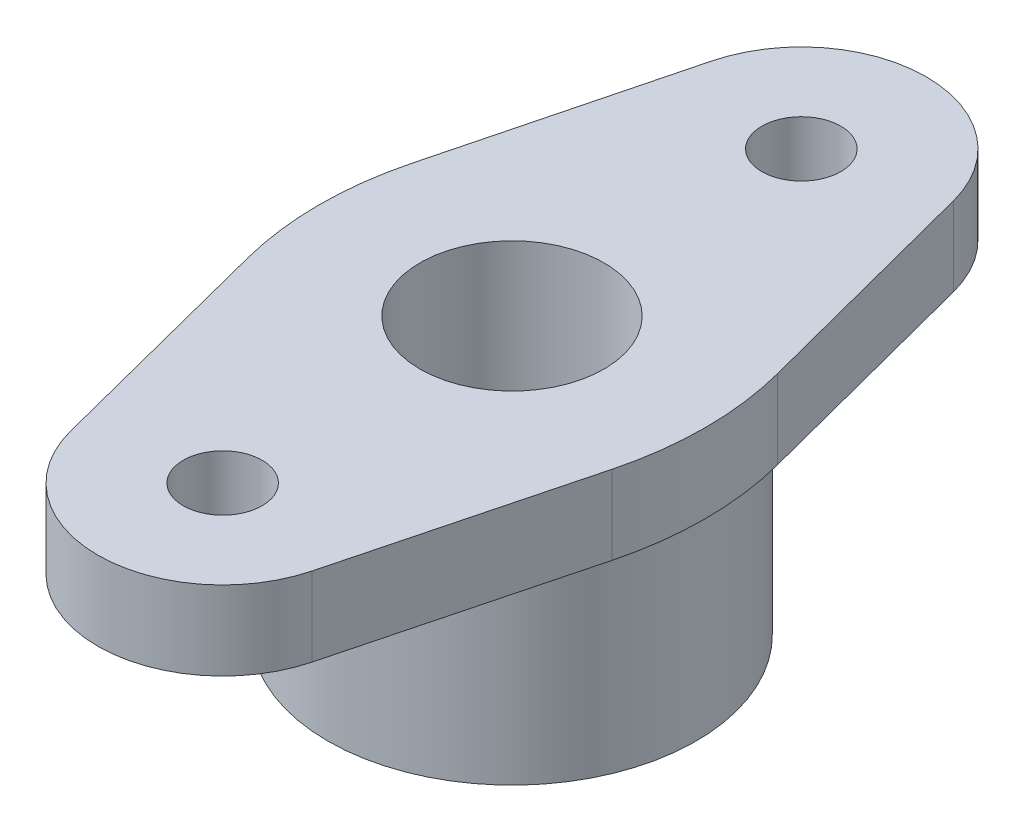
ISO-10303-21;
HEADER;
FILE_DESCRIPTION(('STEP AP214'),'2;1');
FILE_NAME('part.step','',(''),(''),'','','');
FILE_SCHEMA(('AUTOMOTIVE_DESIGN { 1 0 10303 214 1 1 1 1 }'));
ENDSEC;
DATA;
#1=APPLICATION_CONTEXT('core data for automotive mechanical design processes');
#2=APPLICATION_PROTOCOL_DEFINITION('international standard','automotive_design',2000,#1);
#3=PRODUCT_CONTEXT('',#1,'mechanical');
#4=PRODUCT('Part','Part','',(#3));
#5=PRODUCT_RELATED_PRODUCT_CATEGORY('part','',(#4));
#6=PRODUCT_DEFINITION_FORMATION('','',#4);
#7=PRODUCT_DEFINITION_CONTEXT('part definition',#1,'design');
#8=PRODUCT_DEFINITION('design','',#6,#7);
#9=PRODUCT_DEFINITION_SHAPE('','',#8);
#10=(LENGTH_UNIT() NAMED_UNIT(*) SI_UNIT(.MILLI.,.METRE.));
#11=(NAMED_UNIT(*) PLANE_ANGLE_UNIT() SI_UNIT($,.RADIAN.));
#12=(NAMED_UNIT(*) SI_UNIT($,.STERADIAN.) SOLID_ANGLE_UNIT());
#13=UNCERTAINTY_MEASURE_WITH_UNIT(LENGTH_MEASURE(1.E-05),#10,'distance_accuracy_value','');
#14=(GEOMETRIC_REPRESENTATION_CONTEXT(3) GLOBAL_UNCERTAINTY_ASSIGNED_CONTEXT((#13)) GLOBAL_UNIT_ASSIGNED_CONTEXT((#10,
#11,#12)) REPRESENTATION_CONTEXT('',''));
#15=CARTESIAN_POINT('',(0.,0.,0.));
#16=DIRECTION('',(0.,0.,1.));
#17=DIRECTION('',(1.,0.,0.));
#18=AXIS2_PLACEMENT_3D('',#15,#16,#17);
#19=CARTESIAN_POINT('',(-29.0153568552386,12.,7.46240356318299));
#20=DIRECTION('',(-0.968482370874399,0.,0.249082109565307));
#21=DIRECTION('',(0.249082109565307,0.,0.968482370874399));
#22=AXIS2_PLACEMENT_3D('',#19,#20,#21);
#23=PLANE('',#22);
#24=DIRECTION('',(-0.249082109565307,0.,-0.968482370874399));
#25=VECTOR('',#24,1.);
#26=CARTESIAN_POINT('',(-29.0153568552386,12.,7.46240356318299));
#27=LINE('',#26,#25);
#28=CARTESIAN_POINT('',(-18.4011650466136,12.,48.7325600817408));
#29=VERTEX_POINT('',#28);
#30=CARTESIAN_POINT('',(-27.7315506851714,12.,12.4541054782653));
#31=VERTEX_POINT('',#30);
#32=EDGE_CURVE('E119',#29,#31,#27,.T.);
#33=ORIENTED_EDGE('',*,*,#32,.T.);
#34=DIRECTION('',(0.,-1.,0.));
#35=VECTOR('',#34,1.);
#36=CARTESIAN_POINT('',(-27.7315506851714,0.,12.4541054782653));
#37=LINE('',#36,#35);
#38=CARTESIAN_POINT('',(-27.7315506851714,0.,12.4541054782653));
#39=VERTEX_POINT('',#38);
#40=EDGE_CURVE('E128',#31,#39,#37,.T.);
#41=ORIENTED_EDGE('',*,*,#40,.T.);
#42=DIRECTION('',(-0.249082109565307,0.,-0.968482370874399));
#43=VECTOR('',#42,1.);
#44=CARTESIAN_POINT('',(-29.0153568552386,0.,7.46240356318299));
#45=LINE('',#44,#43);
#46=CARTESIAN_POINT('',(-18.4011650466136,0.,48.7325600817408));
#47=VERTEX_POINT('',#46);
#48=EDGE_CURVE('E122',#47,#39,#45,.T.);
#49=ORIENTED_EDGE('',*,*,#48,.F.);
#50=DIRECTION('',(0.,-1.,0.));
#51=VECTOR('',#50,1.);
#52=CARTESIAN_POINT('',(-18.4011650466136,12.,48.7325600817408));
#53=LINE('',#52,#51);
#54=EDGE_CURVE('E116',#29,#47,#53,.T.);
#55=ORIENTED_EDGE('',*,*,#54,.F.);
#56=EDGE_LOOP('',(#33,#41,#49,#55));
#57=FACE_BOUND('',#56,.T.);
#58=ADVANCED_FACE('F48',(#57),#23,.T.);
#59=CARTESIAN_POINT('',(0.,12.,44.));
#60=DIRECTION('',(0.,-1.,0.));
#61=DIRECTION('',(0.,0.,-1.));
#62=AXIS2_PLACEMENT_3D('',#59,#60,#61);
#63=CYLINDRICAL_SURFACE('',#62,19.);
#64=CARTESIAN_POINT('',(0.,0.,44.));
#65=DIRECTION('',(0.,1.,0.));
#66=DIRECTION('',(0.,0.,1.));
#67=AXIS2_PLACEMENT_3D('',#64,#65,#66);
#68=CIRCLE('',#67,19.);
#69=CARTESIAN_POINT('',(18.3892056051442,0.,48.7788196462864));
#70=VERTEX_POINT('',#69);
#71=EDGE_CURVE('E170',#70,#47,#68,.F.);
#72=ORIENTED_EDGE('',*,*,#71,.F.);
#73=DIRECTION('',(0.,-1.,0.));
#74=VECTOR('',#73,1.);
#75=CARTESIAN_POINT('',(18.3892056051442,12.,48.7788196462864));
#76=LINE('',#75,#74);
#77=CARTESIAN_POINT('',(18.3892056051442,12.,48.7788196462864));
#78=VERTEX_POINT('',#77);
#79=EDGE_CURVE('E129',#78,#70,#76,.T.);
#80=ORIENTED_EDGE('',*,*,#79,.F.);
#81=CARTESIAN_POINT('',(0.,12.,44.));
#82=DIRECTION('',(0.,1.,0.));
#83=DIRECTION('',(0.,0.,1.));
#84=AXIS2_PLACEMENT_3D('',#81,#82,#83);
#85=CIRCLE('',#84,19.);
#86=EDGE_CURVE('E135',#78,#29,#85,.F.);
#87=ORIENTED_EDGE('',*,*,#86,.T.);
#88=ORIENTED_EDGE('',*,*,#54,.T.);
#89=EDGE_LOOP('',(#72,#80,#87,#88));
#90=FACE_BOUND('',#89,.T.);
#91=ADVANCED_FACE('F141',(#90),#63,.T.);
#92=CARTESIAN_POINT('',(29.1001825279153,12.,7.56229099619282));
#93=DIRECTION('',(-0.967852926586538,0.,-0.251516823488756));
#94=DIRECTION('',(-0.251516823488756,0.,0.967852926586538));
#95=AXIS2_PLACEMENT_3D('',#92,#93,#94);
#96=PLANE('',#95);
#97=DIRECTION('',(0.251516823488756,0.,-0.967852926586538));
#98=VECTOR('',#97,1.);
#99=CARTESIAN_POINT('',(29.1001825279153,0.,7.56229099619282));
#100=LINE('',#99,#98);
#101=CARTESIAN_POINT('',(27.7973066667232,0.,12.5758411744378));
#102=VERTEX_POINT('',#101);
#103=EDGE_CURVE('E174',#70,#102,#100,.T.);
#104=ORIENTED_EDGE('',*,*,#103,.T.);
#105=DIRECTION('',(0.,-1.,0.));
#106=VECTOR('',#105,1.);
#107=CARTESIAN_POINT('',(27.7973066667232,12.,12.5758411744378));
#108=LINE('',#107,#106);
#109=CARTESIAN_POINT('',(27.7973066667232,12.,12.5758411744378));
#110=VERTEX_POINT('',#109);
#111=EDGE_CURVE('E57',#102,#110,#108,.F.);
#112=ORIENTED_EDGE('',*,*,#111,.T.);
#113=DIRECTION('',(0.251516823488756,0.,-0.967852926586538));
#114=VECTOR('',#113,1.);
#115=CARTESIAN_POINT('',(29.1001825279153,12.,7.56229099619282));
#116=LINE('',#115,#114);
#117=EDGE_CURVE('E143',#78,#110,#116,.T.);
#118=ORIENTED_EDGE('',*,*,#117,.F.);
#119=ORIENTED_EDGE('',*,*,#79,.T.);
#120=EDGE_LOOP('',(#104,#112,#118,#119));
#121=FACE_BOUND('',#120,.T.);
#122=ADVANCED_FACE('F242',(#121),#96,.F.);
#123=CARTESIAN_POINT('',(29.1001825279153,12.,-7.56229099619282));
#124=DIRECTION('',(0.967852926586538,0.,-0.251516823488756));
#125=DIRECTION('',(-0.251516823488756,0.,-0.967852926586538));
#126=AXIS2_PLACEMENT_3D('',#123,#124,#125);
#127=PLANE('',#126);
#128=DIRECTION('',(0.251516823488756,0.,0.967852926586538));
#129=VECTOR('',#128,1.);
#130=CARTESIAN_POINT('',(29.1001825279153,12.,-7.56229099619282));
#131=LINE('',#130,#129);
#132=CARTESIAN_POINT('',(18.3892056051442,12.,-48.7788196462864));
#133=VERTEX_POINT('',#132);
#134=CARTESIAN_POINT('',(27.7973066667232,12.,-12.5758411744378));
#135=VERTEX_POINT('',#134);
#136=EDGE_CURVE('E146',#133,#135,#131,.T.);
#137=ORIENTED_EDGE('',*,*,#136,.T.);
#138=DIRECTION('',(0.,-1.,0.));
#139=VECTOR('',#138,1.);
#140=CARTESIAN_POINT('',(27.7973066667232,0.,-12.5758411744378));
#141=LINE('',#140,#139);
#142=CARTESIAN_POINT('',(27.7973066667232,0.,-12.5758411744378));
#143=VERTEX_POINT('',#142);
#144=EDGE_CURVE('E220',#135,#143,#141,.T.);
#145=ORIENTED_EDGE('',*,*,#144,.T.);
#146=DIRECTION('',(0.251516823488756,0.,0.967852926586538));
#147=VECTOR('',#146,1.);
#148=CARTESIAN_POINT('',(29.1001825279153,0.,-7.56229099619282));
#149=LINE('',#148,#147);
#150=CARTESIAN_POINT('',(18.3892056051442,0.,-48.7788196462864));
#151=VERTEX_POINT('',#150);
#152=EDGE_CURVE('E177',#151,#143,#149,.T.);
#153=ORIENTED_EDGE('',*,*,#152,.F.);
#154=DIRECTION('',(0.,-1.,0.));
#155=VECTOR('',#154,1.);
#156=CARTESIAN_POINT('',(18.3892056051442,12.,-48.7788196462864));
#157=LINE('',#156,#155);
#158=EDGE_CURVE('E200',#133,#151,#157,.T.);
#159=ORIENTED_EDGE('',*,*,#158,.F.);
#160=EDGE_LOOP('',(#137,#145,#153,#159));
#161=FACE_BOUND('',#160,.T.);
#162=ADVANCED_FACE('F227',(#161),#127,.T.);
#163=CARTESIAN_POINT('',(0.,12.,-44.));
#164=DIRECTION('',(0.,-1.,0.));
#165=DIRECTION('',(0.,0.,-1.));
#166=AXIS2_PLACEMENT_3D('',#163,#164,#165);
#167=CYLINDRICAL_SURFACE('',#166,19.);
#168=CARTESIAN_POINT('',(0.,0.,-44.));
#169=DIRECTION('',(0.,1.,0.));
#170=DIRECTION('',(0.,0.,1.));
#171=AXIS2_PLACEMENT_3D('',#168,#169,#170);
#172=CIRCLE('',#171,19.);
#173=CARTESIAN_POINT('',(-18.4011650466136,0.,-48.7325600817408));
#174=VERTEX_POINT('',#173);
#175=EDGE_CURVE('E181',#151,#174,#172,.T.);
#176=ORIENTED_EDGE('',*,*,#175,.T.);
#177=DIRECTION('',(0.,-1.,0.));
#178=VECTOR('',#177,1.);
#179=CARTESIAN_POINT('',(-18.4011650466136,12.,-48.7325600817408));
#180=LINE('',#179,#178);
#181=CARTESIAN_POINT('',(-18.4011650466136,12.,-48.7325600817408));
#182=VERTEX_POINT('',#181);
#183=EDGE_CURVE('E167',#182,#174,#180,.T.);
#184=ORIENTED_EDGE('',*,*,#183,.F.);
#185=CARTESIAN_POINT('',(0.,12.,-44.));
#186=DIRECTION('',(0.,1.,0.));
#187=DIRECTION('',(0.,0.,1.));
#188=AXIS2_PLACEMENT_3D('',#185,#186,#187);
#189=CIRCLE('',#188,19.);
#190=EDGE_CURVE('E152',#133,#182,#189,.T.);
#191=ORIENTED_EDGE('',*,*,#190,.F.);
#192=ORIENTED_EDGE('',*,*,#158,.T.);
#193=EDGE_LOOP('',(#176,#184,#191,#192));
#194=FACE_BOUND('',#193,.T.);
#195=ADVANCED_FACE('F236',(#194),#167,.T.);
#196=CARTESIAN_POINT('',(0.,12.,-44.));
#197=DIRECTION('',(0.,-1.,0.));
#198=DIRECTION('',(0.,0.,-1.));
#199=AXIS2_PLACEMENT_3D('',#196,#197,#198);
#200=CYLINDRICAL_SURFACE('',#199,6.);
#201=CARTESIAN_POINT('',(0.,12.,-44.));
#202=DIRECTION('',(0.,1.,0.));
#203=DIRECTION('',(0.,0.,1.));
#204=AXIS2_PLACEMENT_3D('',#201,#202,#203);
#205=CIRCLE('',#204,6.);
#206=CARTESIAN_POINT('',(0.,12.,-38.));
#207=VERTEX_POINT('',#206);
#208=EDGE_CURVE('E159',#207,#207,#205,.T.);
#209=ORIENTED_EDGE('',*,*,#208,.T.);
#210=EDGE_LOOP('',(#209));
#211=FACE_BOUND('',#210,.T.);
#212=CARTESIAN_POINT('',(0.,0.,-44.));
#213=DIRECTION('',(0.,1.,0.));
#214=DIRECTION('',(0.,0.,1.));
#215=AXIS2_PLACEMENT_3D('',#212,#213,#214);
#216=CIRCLE('',#215,6.);
#217=CARTESIAN_POINT('',(0.,0.,-38.));
#218=VERTEX_POINT('',#217);
#219=EDGE_CURVE('E189',#218,#218,#216,.T.);
#220=ORIENTED_EDGE('',*,*,#219,.F.);
#221=EDGE_LOOP('',(#220));
#222=FACE_BOUND('',#221,.T.);
#223=ADVANCED_FACE('F271',(#211,#222),#200,.F.);
#224=CARTESIAN_POINT('',(-29.0153568552386,12.,-7.46240356318299));
#225=DIRECTION('',(0.968482370874399,0.,0.249082109565307));
#226=DIRECTION('',(0.249082109565307,0.,-0.968482370874399));
#227=AXIS2_PLACEMENT_3D('',#224,#225,#226);
#228=PLANE('',#227);
#229=DIRECTION('',(-0.249082109565307,0.,0.968482370874399));
#230=VECTOR('',#229,1.);
#231=CARTESIAN_POINT('',(-29.0153568552386,0.,-7.46240356318299));
#232=LINE('',#231,#230);
#233=CARTESIAN_POINT('',(-27.7315506851714,0.,-12.4541054782653));
#234=VERTEX_POINT('',#233);
#235=EDGE_CURVE('E185',#174,#234,#232,.T.);
#236=ORIENTED_EDGE('',*,*,#235,.T.);
#237=DIRECTION('',(0.,-1.,0.));
#238=VECTOR('',#237,1.);
#239=CARTESIAN_POINT('',(-27.7315506851714,12.,-12.4541054782653));
#240=LINE('',#239,#238);
#241=CARTESIAN_POINT('',(-27.7315506851714,12.,-12.4541054782653));
#242=VERTEX_POINT('',#241);
#243=EDGE_CURVE('E213',#234,#242,#240,.F.);
#244=ORIENTED_EDGE('',*,*,#243,.T.);
#245=DIRECTION('',(-0.249082109565307,0.,0.968482370874399));
#246=VECTOR('',#245,1.);
#247=CARTESIAN_POINT('',(-29.0153568552386,12.,-7.46240356318299));
#248=LINE('',#247,#246);
#249=EDGE_CURVE('E156',#182,#242,#248,.T.);
#250=ORIENTED_EDGE('',*,*,#249,.F.);
#251=ORIENTED_EDGE('',*,*,#183,.T.);
#252=EDGE_LOOP('',(#236,#244,#250,#251));
#253=FACE_BOUND('',#252,.T.);
#254=ADVANCED_FACE('F263',(#253),#228,.F.);
#255=CARTESIAN_POINT('',(0.,12.,0.));
#256=DIRECTION('',(0.,-1.,0.));
#257=DIRECTION('',(0.,0.,-1.));
#258=AXIS2_PLACEMENT_3D('',#255,#256,#257);
#259=CYLINDRICAL_SURFACE('',#258,14.);
#260=CARTESIAN_POINT('',(0.,12.,0.));
#261=DIRECTION('',(0.,1.,0.));
#262=DIRECTION('',(0.,0.,1.));
#263=AXIS2_PLACEMENT_3D('',#260,#261,#262);
#264=CIRCLE('',#263,14.);
#265=CARTESIAN_POINT('',(0.,12.,14.));
#266=VERTEX_POINT('',#265);
#267=EDGE_CURVE('E139',#266,#266,#264,.T.);
#268=ORIENTED_EDGE('',*,*,#267,.T.);
#269=EDGE_LOOP('',(#268));
#270=FACE_BOUND('',#269,.T.);
#271=CARTESIAN_POINT('',(0.,-21.9170962313451,0.));
#272=DIRECTION('',(0.,1.,0.));
#273=DIRECTION('',(0.,0.,1.));
#274=AXIS2_PLACEMENT_3D('',#271,#272,#273);
#275=CIRCLE('',#274,14.);
#276=CARTESIAN_POINT('',(0.,-21.9170962313451,14.));
#277=VERTEX_POINT('',#276);
#278=EDGE_CURVE('E278',#277,#277,#275,.T.);
#279=ORIENTED_EDGE('',*,*,#278,.F.);
#280=EDGE_LOOP('',(#279));
#281=FACE_BOUND('',#280,.T.);
#282=ADVANCED_FACE('F260',(#270,#281),#259,.F.);
#283=CARTESIAN_POINT('',(0.,12.,44.));
#284=DIRECTION('',(0.,-1.,0.));
#285=DIRECTION('',(0.,0.,-1.));
#286=AXIS2_PLACEMENT_3D('',#283,#284,#285);
#287=CYLINDRICAL_SURFACE('',#286,6.);
#288=CARTESIAN_POINT('',(0.,12.,44.));
#289=DIRECTION('',(0.,1.,0.));
#290=DIRECTION('',(0.,0.,1.));
#291=AXIS2_PLACEMENT_3D('',#288,#289,#290);
#292=CIRCLE('',#291,6.);
#293=CARTESIAN_POINT('',(0.,12.,50.));
#294=VERTEX_POINT('',#293);
#295=EDGE_CURVE('E163',#294,#294,#292,.F.);
#296=ORIENTED_EDGE('',*,*,#295,.F.);
#297=EDGE_LOOP('',(#296));
#298=FACE_BOUND('',#297,.T.);
#299=CARTESIAN_POINT('',(0.,0.,44.));
#300=DIRECTION('',(0.,1.,0.));
#301=DIRECTION('',(0.,0.,1.));
#302=AXIS2_PLACEMENT_3D('',#299,#300,#301);
#303=CIRCLE('',#302,6.);
#304=CARTESIAN_POINT('',(0.,0.,50.));
#305=VERTEX_POINT('',#304);
#306=EDGE_CURVE('E193',#305,#305,#303,.F.);
#307=ORIENTED_EDGE('',*,*,#306,.T.);
#308=EDGE_LOOP('',(#307));
#309=FACE_BOUND('',#308,.T.);
#310=ADVANCED_FACE('F262',(#298,#309),#287,.F.);
#311=CARTESIAN_POINT('',(0.,12.,0.));
#312=DIRECTION('',(0.,1.,0.));
#313=DIRECTION('',(0.,0.,1.));
#314=AXIS2_PLACEMENT_3D('',#311,#312,#313);
#315=PLANE('',#314);
#316=ORIENTED_EDGE('',*,*,#267,.F.);
#317=EDGE_LOOP('',(#316));
#318=FACE_BOUND('',#317,.T.);
#319=ORIENTED_EDGE('',*,*,#249,.T.);
#320=CARTESIAN_POINT('',(20.6925678585485,12.,0.));
#321=DIRECTION('',(0.,1.,0.));
#322=DIRECTION('',(0.,0.,1.));
#323=AXIS2_PLACEMENT_3D('',#320,#321,#322);
#324=CIRCLE('',#323,50.);
#325=EDGE_CURVE('E137',#242,#31,#324,.T.);
#326=ORIENTED_EDGE('',*,*,#325,.T.);
#327=ORIENTED_EDGE('',*,*,#32,.F.);
#328=ORIENTED_EDGE('',*,*,#86,.F.);
#329=ORIENTED_EDGE('',*,*,#117,.T.);
#330=CARTESIAN_POINT('',(-20.5953396626037,12.,0.));
#331=DIRECTION('',(0.,1.,0.));
#332=DIRECTION('',(0.,0.,1.));
#333=AXIS2_PLACEMENT_3D('',#330,#331,#332);
#334=CIRCLE('',#333,50.);
#335=EDGE_CURVE('E64',#110,#135,#334,.T.);
#336=ORIENTED_EDGE('',*,*,#335,.T.);
#337=ORIENTED_EDGE('',*,*,#136,.F.);
#338=ORIENTED_EDGE('',*,*,#190,.T.);
#339=EDGE_LOOP('',(#319,#326,#327,#328,#329,#336,#337,#338));
#340=FACE_BOUND('',#339,.T.);
#341=ORIENTED_EDGE('',*,*,#208,.F.);
#342=EDGE_LOOP('',(#341));
#343=FACE_BOUND('',#342,.T.);
#344=ORIENTED_EDGE('',*,*,#295,.T.);
#345=EDGE_LOOP('',(#344));
#346=FACE_BOUND('',#345,.T.);
#347=ADVANCED_FACE('F133',(#318,#340,#343,#346),#315,.T.);
#348=CARTESIAN_POINT('',(0.,0.,0.));
#349=DIRECTION('',(0.,1.,0.));
#350=DIRECTION('',(0.,0.,1.));
#351=AXIS2_PLACEMENT_3D('',#348,#349,#350);
#352=PLANE('',#351);
#353=CARTESIAN_POINT('',(0.,0.,0.));
#354=DIRECTION('',(0.,1.,0.));
#355=DIRECTION('',(0.,0.,1.));
#356=AXIS2_PLACEMENT_3D('',#353,#354,#355);
#357=CIRCLE('',#356,28.);
#358=CARTESIAN_POINT('',(0.,0.,28.));
#359=VERTEX_POINT('',#358);
#360=EDGE_CURVE('E12',#359,#359,#357,.F.);
#361=ORIENTED_EDGE('',*,*,#360,.F.);
#362=EDGE_LOOP('',(#361));
#363=FACE_BOUND('',#362,.T.);
#364=ORIENTED_EDGE('',*,*,#48,.T.);
#365=CARTESIAN_POINT('',(20.6925678585485,0.,0.));
#366=DIRECTION('',(0.,1.,0.));
#367=DIRECTION('',(0.,0.,1.));
#368=AXIS2_PLACEMENT_3D('',#365,#366,#367);
#369=CIRCLE('',#368,50.);
#370=EDGE_CURVE('E210',#39,#234,#369,.F.);
#371=ORIENTED_EDGE('',*,*,#370,.T.);
#372=ORIENTED_EDGE('',*,*,#235,.F.);
#373=ORIENTED_EDGE('',*,*,#175,.F.);
#374=ORIENTED_EDGE('',*,*,#152,.T.);
#375=CARTESIAN_POINT('',(-20.5953396626037,0.,0.));
#376=DIRECTION('',(0.,1.,0.));
#377=DIRECTION('',(0.,0.,1.));
#378=AXIS2_PLACEMENT_3D('',#375,#376,#377);
#379=CIRCLE('',#378,50.);
#380=EDGE_CURVE('E207',#143,#102,#379,.F.);
#381=ORIENTED_EDGE('',*,*,#380,.T.);
#382=ORIENTED_EDGE('',*,*,#103,.F.);
#383=ORIENTED_EDGE('',*,*,#71,.T.);
#384=EDGE_LOOP('',(#364,#371,#372,#373,#374,#381,#382,#383));
#385=FACE_BOUND('',#384,.T.);
#386=ORIENTED_EDGE('',*,*,#219,.T.);
#387=EDGE_LOOP('',(#386));
#388=FACE_BOUND('',#387,.T.);
#389=ORIENTED_EDGE('',*,*,#306,.F.);
#390=EDGE_LOOP('',(#389));
#391=FACE_BOUND('',#390,.T.);
#392=ADVANCED_FACE('F231',(#363,#385,#388,#391),#352,.F.);
#393=CARTESIAN_POINT('',(20.6925678585485,12.,0.));
#394=DIRECTION('',(0.,1.,0.));
#395=DIRECTION('',(0.,0.,1.));
#396=AXIS2_PLACEMENT_3D('',#393,#394,#395);
#397=CYLINDRICAL_SURFACE('',#396,50.);
#398=ORIENTED_EDGE('',*,*,#325,.F.);
#399=ORIENTED_EDGE('',*,*,#243,.F.);
#400=ORIENTED_EDGE('',*,*,#370,.F.);
#401=ORIENTED_EDGE('',*,*,#40,.F.);
#402=EDGE_LOOP('',(#398,#399,#400,#401));
#403=FACE_BOUND('',#402,.T.);
#404=ADVANCED_FACE('F241',(#403),#397,.T.);
#405=CARTESIAN_POINT('',(-20.5953396626037,12.,0.));
#406=DIRECTION('',(0.,1.,0.));
#407=DIRECTION('',(0.,0.,1.));
#408=AXIS2_PLACEMENT_3D('',#405,#406,#407);
#409=CYLINDRICAL_SURFACE('',#408,50.);
#410=ORIENTED_EDGE('',*,*,#335,.F.);
#411=ORIENTED_EDGE('',*,*,#111,.F.);
#412=ORIENTED_EDGE('',*,*,#380,.F.);
#413=ORIENTED_EDGE('',*,*,#144,.F.);
#414=EDGE_LOOP('',(#410,#411,#412,#413));
#415=FACE_BOUND('',#414,.T.);
#416=ADVANCED_FACE('F50',(#415),#409,.T.);
#417=CARTESIAN_POINT('',(0.,0.,0.));
#418=DIRECTION('',(0.,1.,0.));
#419=DIRECTION('',(0.,0.,1.));
#420=AXIS2_PLACEMENT_3D('',#417,#418,#419);
#421=CYLINDRICAL_SURFACE('',#420,28.);
#422=ORIENTED_EDGE('',*,*,#360,.T.);
#423=EDGE_LOOP('',(#422));
#424=FACE_BOUND('',#423,.T.);
#425=CARTESIAN_POINT('',(0.,-30.,0.));
#426=DIRECTION('',(0.,1.,0.));
#427=DIRECTION('',(0.,0.,1.));
#428=AXIS2_PLACEMENT_3D('',#425,#426,#427);
#429=CIRCLE('',#428,28.);
#430=CARTESIAN_POINT('',(0.,-30.,28.));
#431=VERTEX_POINT('',#430);
#432=EDGE_CURVE('E171',#431,#431,#429,.T.);
#433=ORIENTED_EDGE('',*,*,#432,.T.);
#434=EDGE_LOOP('',(#433));
#435=FACE_BOUND('',#434,.T.);
#436=ADVANCED_FACE('F244',(#424,#435),#421,.T.);
#437=CARTESIAN_POINT('',(0.,-21.9170962313451,0.));
#438=DIRECTION('',(0.,-1.,0.));
#439=DIRECTION('',(0.,0.,-1.));
#440=AXIS2_PLACEMENT_3D('',#437,#438,#439);
#441=CONICAL_SURFACE('',#440,14.,1.04719755119659);
#442=ORIENTED_EDGE('',*,*,#432,.F.);
#443=EDGE_LOOP('',(#442));
#444=FACE_BOUND('',#443,.T.);
#445=ORIENTED_EDGE('',*,*,#278,.T.);
#446=EDGE_LOOP('',(#445));
#447=FACE_BOUND('',#446,.T.);
#448=ADVANCED_FACE('F249',(#444,#447),#441,.F.);
#449=CLOSED_SHELL('',(#58,#91,#122,#162,#195,#223,#254,#282,#310,#347,#392,#404,#416,#436,#448));
#450=MANIFOLD_SOLID_BREP('B2',#449);
#451=ADVANCED_BREP_SHAPE_REPRESENTATION('',(#18,#450),#14);
#452=SHAPE_DEFINITION_REPRESENTATION(#9,#451);
ENDSEC;
END-ISO-10303-21;
